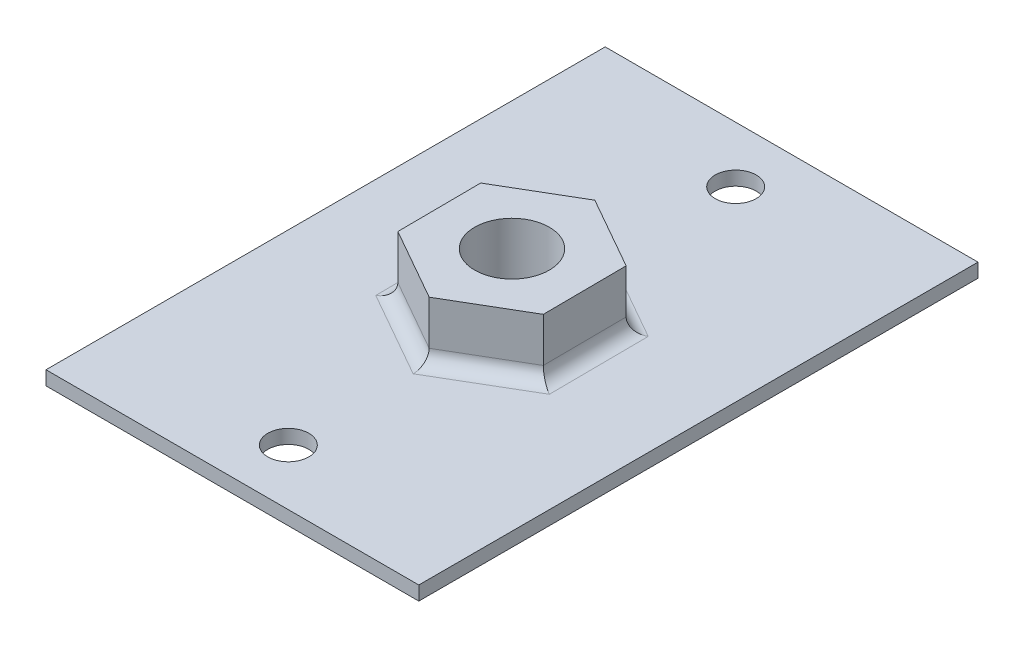
ISO-10303-21;
HEADER;
FILE_DESCRIPTION(('STEP AP214'),'2;1');
FILE_NAME('part.step','',(''),(''),'','','');
FILE_SCHEMA(('AUTOMOTIVE_DESIGN { 1 0 10303 214 1 1 1 1 }'));
ENDSEC;
DATA;
#1=APPLICATION_CONTEXT('core data for automotive mechanical design processes');
#2=APPLICATION_PROTOCOL_DEFINITION('international standard','automotive_design',2000,#1);
#3=PRODUCT_CONTEXT('',#1,'mechanical');
#4=PRODUCT('Part','Part','',(#3));
#5=PRODUCT_RELATED_PRODUCT_CATEGORY('part','',(#4));
#6=PRODUCT_DEFINITION_FORMATION('','',#4);
#7=PRODUCT_DEFINITION_CONTEXT('part definition',#1,'design');
#8=PRODUCT_DEFINITION('design','',#6,#7);
#9=PRODUCT_DEFINITION_SHAPE('','',#8);
#10=(LENGTH_UNIT() NAMED_UNIT(*) SI_UNIT(.MILLI.,.METRE.));
#11=(NAMED_UNIT(*) PLANE_ANGLE_UNIT() SI_UNIT($,.RADIAN.));
#12=(NAMED_UNIT(*) SI_UNIT($,.STERADIAN.) SOLID_ANGLE_UNIT());
#13=UNCERTAINTY_MEASURE_WITH_UNIT(LENGTH_MEASURE(1.E-05),#10,'distance_accuracy_value','');
#14=(GEOMETRIC_REPRESENTATION_CONTEXT(3) GLOBAL_UNCERTAINTY_ASSIGNED_CONTEXT((#13)) GLOBAL_UNIT_ASSIGNED_CONTEXT((#10,
#11,#12)) REPRESENTATION_CONTEXT('',''));
#15=CARTESIAN_POINT('',(0.,0.,0.));
#16=DIRECTION('',(0.,0.,1.));
#17=DIRECTION('',(1.,0.,0.));
#18=AXIS2_PLACEMENT_3D('',#15,#16,#17);
#19=CARTESIAN_POINT('',(3.89035270259153,3.125,2.21042737559322));
#20=DIRECTION('',(0.,-1.,0.));
#21=DIRECTION('',(0.,0.,-1.));
#22=AXIS2_PLACEMENT_3D('',#19,#20,#21);
#23=PLANE('',#22);
#24=DIRECTION('',(-0.00690363957882424,0.,-0.999976169596339));
#25=VECTOR('',#24,1.);
#26=CARTESIAN_POINT('',(3.89035270259153,3.125,2.21042737559322));
#27=LINE('',#26,#25);
#28=CARTESIAN_POINT('',(3.89035270259153,3.125,2.21042737559322));
#29=VERTEX_POINT('',#28);
#30=CARTESIAN_POINT('',(3.85946261178006,3.125,-2.2639305823291));
#31=VERTEX_POINT('',#30);
#32=EDGE_CURVE('E166',#29,#31,#27,.T.);
#33=ORIENTED_EDGE('',*,*,#32,.T.);
#34=DIRECTION('',(-0.869456585838897,0.,-0.494009357544337));
#35=VECTOR('',#34,1.);
#36=CARTESIAN_POINT('',(3.85946261178006,3.125,-2.2639305823291));
#37=LINE('',#36,#35);
#38=CARTESIAN_POINT('',(-0.0308900908114723,3.125,-4.47435795792232));
#39=VERTEX_POINT('',#38);
#40=EDGE_CURVE('E169',#31,#39,#37,.T.);
#41=ORIENTED_EDGE('',*,*,#40,.T.);
#42=DIRECTION('',(-0.862552946260073,0.,0.505966812052003));
#43=VECTOR('',#42,1.);
#44=CARTESIAN_POINT('',(-0.0308900908114723,3.125,-4.47435795792232));
#45=LINE('',#44,#43);
#46=CARTESIAN_POINT('',(-3.89035270259153,3.125,-2.21042737559322));
#47=VERTEX_POINT('',#46);
#48=EDGE_CURVE('E171',#39,#47,#45,.T.);
#49=ORIENTED_EDGE('',*,*,#48,.T.);
#50=DIRECTION('',(0.00690363957882444,0.,0.999976169596339));
#51=VECTOR('',#50,1.);
#52=CARTESIAN_POINT('',(-3.89035270259153,3.125,-2.21042737559322));
#53=LINE('',#52,#51);
#54=CARTESIAN_POINT('',(-3.85946261178006,3.125,2.2639305823291));
#55=VERTEX_POINT('',#54);
#56=EDGE_CURVE('E173',#47,#55,#53,.T.);
#57=ORIENTED_EDGE('',*,*,#56,.T.);
#58=DIRECTION('',(0.869456585838897,0.,0.494009357544337));
#59=VECTOR('',#58,1.);
#60=CARTESIAN_POINT('',(-3.85946261178006,3.125,2.2639305823291));
#61=LINE('',#60,#59);
#62=CARTESIAN_POINT('',(0.0308900908114716,3.125,4.47435795792233));
#63=VERTEX_POINT('',#62);
#64=EDGE_CURVE('E175',#55,#63,#61,.T.);
#65=ORIENTED_EDGE('',*,*,#64,.T.);
#66=DIRECTION('',(0.862552946260074,0.,-0.505966812052003));
#67=VECTOR('',#66,1.);
#68=CARTESIAN_POINT('',(0.0308900908114716,3.125,4.47435795792233));
#69=LINE('',#68,#67);
#70=EDGE_CURVE('E177',#63,#29,#69,.T.);
#71=ORIENTED_EDGE('',*,*,#70,.T.);
#72=EDGE_LOOP('',(#33,#41,#49,#57,#65,#71));
#73=FACE_BOUND('',#72,.T.);
#74=CARTESIAN_POINT('',(0.,3.125,0.));
#75=DIRECTION('',(0.,1.,0.));
#76=DIRECTION('',(0.,0.,1.));
#77=AXIS2_PLACEMENT_3D('',#74,#75,#76);
#78=CIRCLE('',#77,2.);
#79=CARTESIAN_POINT('',(0.,3.125,2.));
#80=VERTEX_POINT('',#79);
#81=EDGE_CURVE('E158',#80,#80,#78,.T.);
#82=ORIENTED_EDGE('',*,*,#81,.F.);
#83=EDGE_LOOP('',(#82));
#84=FACE_BOUND('',#83,.T.);
#85=ADVANCED_FACE('F32',(#73,#84),#23,.F.);
#86=CARTESIAN_POINT('',(3.89035270259153,3.125,2.21042737559322));
#87=DIRECTION('',(-0.999976169596339,0.,0.00690363957882425));
#88=DIRECTION('',(0.00690363957882425,0.,0.999976169596339));
#89=AXIS2_PLACEMENT_3D('',#86,#87,#88);
#90=PLANE('',#89);
#91=DIRECTION('',(0.,-1.,0.));
#92=VECTOR('',#91,1.);
#93=CARTESIAN_POINT('',(3.89035270259153,3.125,2.21042737559322));
#94=LINE('',#93,#92);
#95=CARTESIAN_POINT('',(3.89035270259153,0.75,2.21042737559322));
#96=VERTEX_POINT('',#95);
#97=EDGE_CURVE('E179',#29,#96,#94,.T.);
#98=ORIENTED_EDGE('',*,*,#97,.T.);
#99=DIRECTION('',(-0.00690363957882425,0.,-0.999976169596339));
#100=VECTOR('',#99,1.);
#101=CARTESIAN_POINT('',(3.85946261178006,0.75,-2.2639305823291));
#102=LINE('',#101,#100);
#103=CARTESIAN_POINT('',(3.85946261178006,0.75,-2.2639305823291));
#104=VERTEX_POINT('',#103);
#105=EDGE_CURVE('E11',#96,#104,#102,.T.);
#106=ORIENTED_EDGE('',*,*,#105,.T.);
#107=DIRECTION('',(0.,-1.,0.));
#108=VECTOR('',#107,1.);
#109=CARTESIAN_POINT('',(3.85946261178006,3.125,-2.2639305823291));
#110=LINE('',#109,#108);
#111=EDGE_CURVE('E191',#31,#104,#110,.T.);
#112=ORIENTED_EDGE('',*,*,#111,.F.);
#113=ORIENTED_EDGE('',*,*,#32,.F.);
#114=EDGE_LOOP('',(#98,#106,#112,#113));
#115=FACE_BOUND('',#114,.T.);
#116=ADVANCED_FACE('F34',(#115),#90,.F.);
#117=CARTESIAN_POINT('',(3.85946261178006,3.125,-2.2639305823291));
#118=DIRECTION('',(-0.494009357544337,0.,0.869456585838898));
#119=DIRECTION('',(0.869456585838898,0.,0.494009357544337));
#120=AXIS2_PLACEMENT_3D('',#117,#118,#119);
#121=PLANE('',#120);
#122=ORIENTED_EDGE('',*,*,#111,.T.);
#123=DIRECTION('',(-0.869456585838898,0.,-0.494009357544337));
#124=VECTOR('',#123,1.);
#125=CARTESIAN_POINT('',(-0.0308900908114742,0.75,-4.47435795792232));
#126=LINE('',#125,#124);
#127=CARTESIAN_POINT('',(-0.0308900908114723,0.75,-4.47435795792232));
#128=VERTEX_POINT('',#127);
#129=EDGE_CURVE('E194',#104,#128,#126,.T.);
#130=ORIENTED_EDGE('',*,*,#129,.T.);
#131=DIRECTION('',(0.,-1.,0.));
#132=VECTOR('',#131,1.);
#133=CARTESIAN_POINT('',(-0.0308900908114723,3.125,-4.47435795792232));
#134=LINE('',#133,#132);
#135=EDGE_CURVE('E188',#39,#128,#134,.T.);
#136=ORIENTED_EDGE('',*,*,#135,.F.);
#137=ORIENTED_EDGE('',*,*,#40,.F.);
#138=EDGE_LOOP('',(#122,#130,#136,#137));
#139=FACE_BOUND('',#138,.T.);
#140=ADVANCED_FACE('F303',(#139),#121,.F.);
#141=CARTESIAN_POINT('',(-0.0308900908114723,3.125,-4.47435795792232));
#142=DIRECTION('',(0.505966812052003,0.,0.862552946260073));
#143=DIRECTION('',(0.862552946260073,0.,-0.505966812052003));
#144=AXIS2_PLACEMENT_3D('',#141,#142,#143);
#145=PLANE('',#144);
#146=ORIENTED_EDGE('',*,*,#135,.T.);
#147=DIRECTION('',(-0.862552946260073,0.,0.505966812052003));
#148=VECTOR('',#147,1.);
#149=CARTESIAN_POINT('',(-3.89035270259153,0.75,-2.21042737559322));
#150=LINE('',#149,#148);
#151=CARTESIAN_POINT('',(-3.89035270259153,0.75,-2.21042737559322));
#152=VERTEX_POINT('',#151);
#153=EDGE_CURVE('E210',#128,#152,#150,.T.);
#154=ORIENTED_EDGE('',*,*,#153,.T.);
#155=DIRECTION('',(0.,-1.,0.));
#156=VECTOR('',#155,1.);
#157=CARTESIAN_POINT('',(-3.89035270259153,3.125,-2.21042737559322));
#158=LINE('',#157,#156);
#159=EDGE_CURVE('E185',#47,#152,#158,.T.);
#160=ORIENTED_EDGE('',*,*,#159,.F.);
#161=ORIENTED_EDGE('',*,*,#48,.F.);
#162=EDGE_LOOP('',(#146,#154,#160,#161));
#163=FACE_BOUND('',#162,.T.);
#164=ADVANCED_FACE('F316',(#163),#145,.F.);
#165=CARTESIAN_POINT('',(-3.89035270259153,3.125,-2.21042737559322));
#166=DIRECTION('',(0.999976169596339,0.,-0.00690363957882444));
#167=DIRECTION('',(-0.00690363957882444,0.,-0.999976169596339));
#168=AXIS2_PLACEMENT_3D('',#165,#166,#167);
#169=PLANE('',#168);
#170=ORIENTED_EDGE('',*,*,#159,.T.);
#171=DIRECTION('',(0.00690363957882444,0.,0.999976169596339));
#172=VECTOR('',#171,1.);
#173=CARTESIAN_POINT('',(-3.85946261178006,0.75,2.26393058232911));
#174=LINE('',#173,#172);
#175=CARTESIAN_POINT('',(-3.85946261178006,0.75,2.2639305823291));
#176=VERTEX_POINT('',#175);
#177=EDGE_CURVE('E212',#152,#176,#174,.T.);
#178=ORIENTED_EDGE('',*,*,#177,.T.);
#179=DIRECTION('',(0.,-1.,0.));
#180=VECTOR('',#179,1.);
#181=CARTESIAN_POINT('',(-3.85946261178006,3.125,2.2639305823291));
#182=LINE('',#181,#180);
#183=EDGE_CURVE('E183',#55,#176,#182,.T.);
#184=ORIENTED_EDGE('',*,*,#183,.F.);
#185=ORIENTED_EDGE('',*,*,#56,.F.);
#186=EDGE_LOOP('',(#170,#178,#184,#185));
#187=FACE_BOUND('',#186,.T.);
#188=ADVANCED_FACE('F217',(#187),#169,.F.);
#189=CARTESIAN_POINT('',(-3.85946261178006,3.125,2.2639305823291));
#190=DIRECTION('',(0.494009357544337,0.,-0.869456585838897));
#191=DIRECTION('',(-0.869456585838897,0.,-0.494009357544337));
#192=AXIS2_PLACEMENT_3D('',#189,#190,#191);
#193=PLANE('',#192);
#194=ORIENTED_EDGE('',*,*,#183,.T.);
#195=DIRECTION('',(0.869456585838897,0.,0.494009357544337));
#196=VECTOR('',#195,1.);
#197=CARTESIAN_POINT('',(0.0308900908114722,0.75,4.47435795792233));
#198=LINE('',#197,#196);
#199=CARTESIAN_POINT('',(0.0308900908114716,0.75,4.47435795792233));
#200=VERTEX_POINT('',#199);
#201=EDGE_CURVE('E54',#176,#200,#198,.T.);
#202=ORIENTED_EDGE('',*,*,#201,.T.);
#203=DIRECTION('',(0.,-1.,0.));
#204=VECTOR('',#203,1.);
#205=CARTESIAN_POINT('',(0.0308900908114716,3.125,4.47435795792233));
#206=LINE('',#205,#204);
#207=EDGE_CURVE('E181',#63,#200,#206,.T.);
#208=ORIENTED_EDGE('',*,*,#207,.F.);
#209=ORIENTED_EDGE('',*,*,#64,.F.);
#210=EDGE_LOOP('',(#194,#202,#208,#209));
#211=FACE_BOUND('',#210,.T.);
#212=ADVANCED_FACE('F225',(#211),#193,.F.);
#213=CARTESIAN_POINT('',(0.0308900908114716,3.125,4.47435795792233));
#214=DIRECTION('',(-0.505966812052003,0.,-0.862552946260074));
#215=DIRECTION('',(-0.862552946260074,0.,0.505966812052003));
#216=AXIS2_PLACEMENT_3D('',#213,#214,#215);
#217=PLANE('',#216);
#218=ORIENTED_EDGE('',*,*,#207,.T.);
#219=DIRECTION('',(0.862552946260074,0.,-0.505966812052003));
#220=VECTOR('',#219,1.);
#221=CARTESIAN_POINT('',(3.89035270259153,0.75,2.21042737559322));
#222=LINE('',#221,#220);
#223=EDGE_CURVE('E40',#200,#96,#222,.T.);
#224=ORIENTED_EDGE('',*,*,#223,.T.);
#225=ORIENTED_EDGE('',*,*,#97,.F.);
#226=ORIENTED_EDGE('',*,*,#70,.F.);
#227=EDGE_LOOP('',(#218,#224,#225,#226));
#228=FACE_BOUND('',#227,.T.);
#229=ADVANCED_FACE('F309',(#228),#217,.F.);
#230=CARTESIAN_POINT('',(0.,3.125,0.));
#231=DIRECTION('',(0.,-1.,0.));
#232=DIRECTION('',(0.,0.,-1.));
#233=AXIS2_PLACEMENT_3D('',#230,#231,#232);
#234=CYLINDRICAL_SURFACE('',#233,2.);
#235=ORIENTED_EDGE('',*,*,#81,.T.);
#236=EDGE_LOOP('',(#235));
#237=FACE_BOUND('',#236,.T.);
#238=CARTESIAN_POINT('',(0.,0.,0.));
#239=DIRECTION('',(0.,1.,0.));
#240=DIRECTION('',(0.,0.,1.));
#241=AXIS2_PLACEMENT_3D('',#238,#239,#240);
#242=CIRCLE('',#241,2.);
#243=CARTESIAN_POINT('',(0.,0.,2.));
#244=VERTEX_POINT('',#243);
#245=EDGE_CURVE('E154',#244,#244,#242,.T.);
#246=ORIENTED_EDGE('',*,*,#245,.F.);
#247=EDGE_LOOP('',(#246));
#248=FACE_BOUND('',#247,.T.);
#249=ADVANCED_FACE('F293',(#237,#248),#234,.F.);
#250=CARTESIAN_POINT('',(10.,0.,15.));
#251=DIRECTION('',(0.,-1.,0.));
#252=DIRECTION('',(0.,0.,-1.));
#253=AXIS2_PLACEMENT_3D('',#250,#251,#252);
#254=PLANE('',#253);
#255=ORIENTED_EDGE('',*,*,#245,.T.);
#256=EDGE_LOOP('',(#255));
#257=FACE_BOUND('',#256,.T.);
#258=ADVANCED_FACE('F287',(#257),#254,.F.);
#259=DIRECTION('',(-0.862552946260073,0.,0.505966812052003));
#260=VECTOR('',#259,1.);
#261=CARTESIAN_POINT('',(-0.410365199850475,0.,-5.12127266761738));
#262=LINE('',#261,#260);
#263=CARTESIAN_POINT('',(-4.6433241934157,0.,-2.63825202893384));
#264=VERTEX_POINT('',#263);
#265=CARTESIAN_POINT('',(-0.036868818065305,0.,-5.34036272397181));
#266=VERTEX_POINT('',#265);
#267=EDGE_CURVE('E205',#264,#266,#262,.F.);
#268=ORIENTED_EDGE('',*,*,#267,.T.);
#269=DIRECTION('',(-0.869456585838898,0.,-0.494009357544337));
#270=VECTOR('',#269,1.);
#271=CARTESIAN_POINT('',(4.22996962993831,0.,-2.91602302170828));
#272=LINE('',#271,#270);
#273=CARTESIAN_POINT('',(4.6064553753504,0.,-2.70211069503796));
#274=VERTEX_POINT('',#273);
#275=EDGE_CURVE('E207',#266,#274,#272,.F.);
#276=ORIENTED_EDGE('',*,*,#275,.T.);
#277=DIRECTION('',(-0.00690363957882425,0.,-0.999976169596339));
#278=VECTOR('',#277,1.);
#279=CARTESIAN_POINT('',(4.64033482978879,0.,2.2052496459091));
#280=LINE('',#279,#278);
#281=CARTESIAN_POINT('',(4.64332419341571,0.,2.63825202893384));
#282=VERTEX_POINT('',#281);
#283=EDGE_CURVE('E197',#274,#282,#280,.F.);
#284=ORIENTED_EDGE('',*,*,#283,.T.);
#285=DIRECTION('',(0.862552946260074,0.,-0.505966812052003));
#286=VECTOR('',#285,1.);
#287=CARTESIAN_POINT('',(0.410365199850474,0.,5.12127266761738));
#288=LINE('',#287,#286);
#289=CARTESIAN_POINT('',(0.0368688180653053,0.,5.34036272397181));
#290=VERTEX_POINT('',#289);
#291=EDGE_CURVE('E199',#282,#290,#288,.F.);
#292=ORIENTED_EDGE('',*,*,#291,.T.);
#293=DIRECTION('',(0.869456585838897,0.,0.494009357544337));
#294=VECTOR('',#293,1.);
#295=CARTESIAN_POINT('',(-4.22996962993831,0.,2.91602302170828));
#296=LINE('',#295,#294);
#297=CARTESIAN_POINT('',(-4.6064553753504,0.,2.70211069503797));
#298=VERTEX_POINT('',#297);
#299=EDGE_CURVE('E201',#290,#298,#296,.F.);
#300=ORIENTED_EDGE('',*,*,#299,.T.);
#301=DIRECTION('',(0.00690363957882444,0.,0.999976169596339));
#302=VECTOR('',#301,1.);
#303=CARTESIAN_POINT('',(-4.64033482978879,0.,-2.2052496459091));
#304=LINE('',#303,#302);
#305=EDGE_CURVE('E203',#298,#264,#304,.F.);
#306=ORIENTED_EDGE('',*,*,#305,.T.);
#307=EDGE_LOOP('',(#268,#276,#284,#292,#300,#306));
#308=FACE_BOUND('',#307,.T.);
#309=CARTESIAN_POINT('',(0.,0.,-12.));
#310=DIRECTION('',(0.,-1.,0.));
#311=DIRECTION('',(0.,0.,-1.));
#312=AXIS2_PLACEMENT_3D('',#309,#310,#311);
#313=CIRCLE('',#312,1.1);
#314=CARTESIAN_POINT('',(0.,0.,-13.1));
#315=VERTEX_POINT('',#314);
#316=EDGE_CURVE('E250',#315,#315,#313,.T.);
#317=ORIENTED_EDGE('',*,*,#316,.T.);
#318=EDGE_LOOP('',(#317));
#319=FACE_BOUND('',#318,.T.);
#320=DIRECTION('',(-1.,0.,0.));
#321=VECTOR('',#320,1.);
#322=CARTESIAN_POINT('',(-10.,0.,15.));
#323=LINE('',#322,#321);
#324=CARTESIAN_POINT('',(10.,0.,15.));
#325=VERTEX_POINT('',#324);
#326=CARTESIAN_POINT('',(-10.,0.,15.));
#327=VERTEX_POINT('',#326);
#328=EDGE_CURVE('E142',#325,#327,#323,.T.);
#329=ORIENTED_EDGE('',*,*,#328,.F.);
#330=DIRECTION('',(0.,0.,1.));
#331=VECTOR('',#330,1.);
#332=CARTESIAN_POINT('',(10.,0.,0.));
#333=LINE('',#332,#331);
#334=CARTESIAN_POINT('',(10.,0.,-15.));
#335=VERTEX_POINT('',#334);
#336=EDGE_CURVE('E129',#335,#325,#333,.T.);
#337=ORIENTED_EDGE('',*,*,#336,.F.);
#338=DIRECTION('',(1.,0.,0.));
#339=VECTOR('',#338,1.);
#340=CARTESIAN_POINT('',(10.,0.,-15.));
#341=LINE('',#340,#339);
#342=CARTESIAN_POINT('',(-10.,0.,-15.));
#343=VERTEX_POINT('',#342);
#344=EDGE_CURVE('E139',#343,#335,#341,.T.);
#345=ORIENTED_EDGE('',*,*,#344,.F.);
#346=DIRECTION('',(0.,0.,-1.));
#347=VECTOR('',#346,1.);
#348=CARTESIAN_POINT('',(-10.,0.,-15.));
#349=LINE('',#348,#347);
#350=EDGE_CURVE('E145',#327,#343,#349,.T.);
#351=ORIENTED_EDGE('',*,*,#350,.F.);
#352=EDGE_LOOP('',(#329,#337,#345,#351));
#353=FACE_BOUND('',#352,.T.);
#354=CARTESIAN_POINT('',(0.,0.,12.));
#355=DIRECTION('',(0.,-1.,0.));
#356=DIRECTION('',(0.,0.,1.));
#357=AXIS2_PLACEMENT_3D('',#354,#355,#356);
#358=CIRCLE('',#357,1.1);
#359=CARTESIAN_POINT('',(0.,0.,13.1));
#360=VERTEX_POINT('',#359);
#361=EDGE_CURVE('E238',#360,#360,#358,.T.);
#362=ORIENTED_EDGE('',*,*,#361,.T.);
#363=EDGE_LOOP('',(#362));
#364=FACE_BOUND('',#363,.T.);
#365=ADVANCED_FACE('F143',(#308,#319,#353,#364),#254,.F.);
#366=CARTESIAN_POINT('',(10.,-0.75,15.));
#367=DIRECTION('',(0.,-1.,0.));
#368=DIRECTION('',(0.,0.,-1.));
#369=AXIS2_PLACEMENT_3D('',#366,#367,#368);
#370=PLANE('',#369);
#371=CARTESIAN_POINT('',(0.,-0.75,-12.));
#372=DIRECTION('',(0.,-1.,0.));
#373=DIRECTION('',(0.,0.,-1.));
#374=AXIS2_PLACEMENT_3D('',#371,#372,#373);
#375=CIRCLE('',#374,1.1);
#376=CARTESIAN_POINT('',(0.,-0.75,-13.1));
#377=VERTEX_POINT('',#376);
#378=EDGE_CURVE('E149',#377,#377,#375,.T.);
#379=ORIENTED_EDGE('',*,*,#378,.F.);
#380=EDGE_LOOP('',(#379));
#381=FACE_BOUND('',#380,.T.);
#382=DIRECTION('',(0.,0.,1.));
#383=VECTOR('',#382,1.);
#384=CARTESIAN_POINT('',(10.,-0.75,15.));
#385=LINE('',#384,#383);
#386=CARTESIAN_POINT('',(10.,-0.75,-15.));
#387=VERTEX_POINT('',#386);
#388=CARTESIAN_POINT('',(10.,-0.75,15.));
#389=VERTEX_POINT('',#388);
#390=EDGE_CURVE('E138',#387,#389,#385,.T.);
#391=ORIENTED_EDGE('',*,*,#390,.T.);
#392=DIRECTION('',(-1.,0.,0.));
#393=VECTOR('',#392,1.);
#394=CARTESIAN_POINT('',(-10.,-0.75,15.));
#395=LINE('',#394,#393);
#396=CARTESIAN_POINT('',(-10.,-0.75,15.));
#397=VERTEX_POINT('',#396);
#398=EDGE_CURVE('E152',#389,#397,#395,.T.);
#399=ORIENTED_EDGE('',*,*,#398,.T.);
#400=DIRECTION('',(0.,0.,-1.));
#401=VECTOR('',#400,1.);
#402=CARTESIAN_POINT('',(-10.,-0.75,-15.));
#403=LINE('',#402,#401);
#404=CARTESIAN_POINT('',(-10.,-0.75,-15.));
#405=VERTEX_POINT('',#404);
#406=EDGE_CURVE('E259',#397,#405,#403,.T.);
#407=ORIENTED_EDGE('',*,*,#406,.T.);
#408=DIRECTION('',(1.,0.,0.));
#409=VECTOR('',#408,1.);
#410=CARTESIAN_POINT('',(10.,-0.75,-15.));
#411=LINE('',#410,#409);
#412=EDGE_CURVE('E261',#405,#387,#411,.T.);
#413=ORIENTED_EDGE('',*,*,#412,.T.);
#414=EDGE_LOOP('',(#391,#399,#407,#413));
#415=FACE_BOUND('',#414,.T.);
#416=CARTESIAN_POINT('',(0.,-0.75,12.));
#417=DIRECTION('',(0.,-1.,0.));
#418=DIRECTION('',(0.,0.,1.));
#419=AXIS2_PLACEMENT_3D('',#416,#417,#418);
#420=CIRCLE('',#419,1.1);
#421=CARTESIAN_POINT('',(0.,-0.75,13.1));
#422=VERTEX_POINT('',#421);
#423=EDGE_CURVE('E247',#422,#422,#420,.T.);
#424=ORIENTED_EDGE('',*,*,#423,.F.);
#425=EDGE_LOOP('',(#424));
#426=FACE_BOUND('',#425,.T.);
#427=ADVANCED_FACE('F273',(#381,#415,#426),#370,.T.);
#428=CARTESIAN_POINT('',(-10.,-0.75,15.));
#429=DIRECTION('',(0.,0.,-1.));
#430=DIRECTION('',(-1.,0.,0.));
#431=AXIS2_PLACEMENT_3D('',#428,#429,#430);
#432=PLANE('',#431);
#433=ORIENTED_EDGE('',*,*,#328,.T.);
#434=DIRECTION('',(0.,1.,0.));
#435=VECTOR('',#434,1.);
#436=CARTESIAN_POINT('',(-10.,-0.75,15.));
#437=LINE('',#436,#435);
#438=EDGE_CURVE('E155',#397,#327,#437,.T.);
#439=ORIENTED_EDGE('',*,*,#438,.F.);
#440=ORIENTED_EDGE('',*,*,#398,.F.);
#441=DIRECTION('',(0.,1.,0.));
#442=VECTOR('',#441,1.);
#443=CARTESIAN_POINT('',(10.,-0.75,15.));
#444=LINE('',#443,#442);
#445=EDGE_CURVE('E133',#389,#325,#444,.T.);
#446=ORIENTED_EDGE('',*,*,#445,.T.);
#447=EDGE_LOOP('',(#433,#439,#440,#446));
#448=FACE_BOUND('',#447,.T.);
#449=ADVANCED_FACE('F151',(#448),#432,.F.);
#450=CARTESIAN_POINT('',(-10.,-0.75,-15.));
#451=DIRECTION('',(1.,0.,0.));
#452=DIRECTION('',(0.,0.,-1.));
#453=AXIS2_PLACEMENT_3D('',#450,#451,#452);
#454=PLANE('',#453);
#455=ORIENTED_EDGE('',*,*,#350,.T.);
#456=DIRECTION('',(0.,1.,0.));
#457=VECTOR('',#456,1.);
#458=CARTESIAN_POINT('',(-10.,-0.75,-15.));
#459=LINE('',#458,#457);
#460=EDGE_CURVE('E160',#405,#343,#459,.T.);
#461=ORIENTED_EDGE('',*,*,#460,.F.);
#462=ORIENTED_EDGE('',*,*,#406,.F.);
#463=ORIENTED_EDGE('',*,*,#438,.T.);
#464=EDGE_LOOP('',(#455,#461,#462,#463));
#465=FACE_BOUND('',#464,.T.);
#466=ADVANCED_FACE('F271',(#465),#454,.F.);
#467=CARTESIAN_POINT('',(10.,-0.75,-15.));
#468=DIRECTION('',(0.,0.,1.));
#469=DIRECTION('',(1.,0.,0.));
#470=AXIS2_PLACEMENT_3D('',#467,#468,#469);
#471=PLANE('',#470);
#472=ORIENTED_EDGE('',*,*,#344,.T.);
#473=DIRECTION('',(0.,1.,0.));
#474=VECTOR('',#473,1.);
#475=CARTESIAN_POINT('',(10.,-0.75,-15.));
#476=LINE('',#475,#474);
#477=EDGE_CURVE('E135',#387,#335,#476,.T.);
#478=ORIENTED_EDGE('',*,*,#477,.F.);
#479=ORIENTED_EDGE('',*,*,#412,.F.);
#480=ORIENTED_EDGE('',*,*,#460,.T.);
#481=EDGE_LOOP('',(#472,#478,#479,#480));
#482=FACE_BOUND('',#481,.T.);
#483=ADVANCED_FACE('F268',(#482),#471,.F.);
#484=CARTESIAN_POINT('',(10.,-0.75,0.));
#485=DIRECTION('',(-1.,0.,0.));
#486=DIRECTION('',(0.,0.,1.));
#487=AXIS2_PLACEMENT_3D('',#484,#485,#486);
#488=PLANE('',#487);
#489=ORIENTED_EDGE('',*,*,#336,.T.);
#490=ORIENTED_EDGE('',*,*,#445,.F.);
#491=ORIENTED_EDGE('',*,*,#390,.F.);
#492=ORIENTED_EDGE('',*,*,#477,.T.);
#493=EDGE_LOOP('',(#489,#490,#491,#492));
#494=FACE_BOUND('',#493,.T.);
#495=ADVANCED_FACE('F131',(#494),#488,.F.);
#496=CARTESIAN_POINT('',(0.,-0.75,-12.));
#497=DIRECTION('',(0.,1.,0.));
#498=DIRECTION('',(0.,0.,1.));
#499=AXIS2_PLACEMENT_3D('',#496,#497,#498);
#500=CYLINDRICAL_SURFACE('',#499,1.1);
#501=ORIENTED_EDGE('',*,*,#378,.T.);
#502=EDGE_LOOP('',(#501));
#503=FACE_BOUND('',#502,.T.);
#504=ORIENTED_EDGE('',*,*,#316,.F.);
#505=EDGE_LOOP('',(#504));
#506=FACE_BOUND('',#505,.T.);
#507=ADVANCED_FACE('F283',(#503,#506),#500,.F.);
#508=CARTESIAN_POINT('',(0.,-0.75,12.));
#509=DIRECTION('',(0.,1.,0.));
#510=DIRECTION('',(0.,0.,1.));
#511=AXIS2_PLACEMENT_3D('',#508,#509,#510);
#512=CYLINDRICAL_SURFACE('',#511,1.1);
#513=ORIENTED_EDGE('',*,*,#423,.T.);
#514=EDGE_LOOP('',(#513));
#515=FACE_BOUND('',#514,.T.);
#516=ORIENTED_EDGE('',*,*,#361,.F.);
#517=EDGE_LOOP('',(#516));
#518=FACE_BOUND('',#517,.T.);
#519=ADVANCED_FACE('F280',(#515,#518),#512,.F.);
#520=CARTESIAN_POINT('',(-4.22996962993831,0.75,2.91602302170828));
#521=DIRECTION('',(-0.869456585838897,0.,-0.494009357544337));
#522=DIRECTION('',(-0.494009357544337,0.,0.869456585838897));
#523=AXIS2_PLACEMENT_3D('',#520,#521,#522);
#524=CYLINDRICAL_SURFACE('',#523,0.75);
#525=CARTESIAN_POINT('',(-4.6064553753504,0.75,2.70211069503797));
#526=DIRECTION('',(-0.505966812052003,0.,-0.862552946260074));
#527=DIRECTION('',(-0.862552946260074,0.,0.505966812052003));
#528=AXIS2_PLACEMENT_3D('',#525,#526,#527);
#529=ELLIPSE('',#528,0.866025403784438,0.75);
#530=EDGE_CURVE('E231',#298,#176,#529,.F.);
#531=ORIENTED_EDGE('',*,*,#530,.F.);
#532=ORIENTED_EDGE('',*,*,#299,.F.);
#533=CARTESIAN_POINT('',(0.0368688180653059,0.75,5.34036272397181));
#534=DIRECTION('',(-0.999976169596339,0.,0.00690363957882389));
#535=DIRECTION('',(0.00690363957882389,0.,0.999976169596339));
#536=AXIS2_PLACEMENT_3D('',#533,#534,#535);
#537=ELLIPSE('',#536,0.866025403784439,0.75);
#538=EDGE_CURVE('E234',#200,#290,#537,.T.);
#539=ORIENTED_EDGE('',*,*,#538,.F.);
#540=ORIENTED_EDGE('',*,*,#201,.F.);
#541=EDGE_LOOP('',(#531,#532,#539,#540));
#542=FACE_BOUND('',#541,.T.);
#543=ADVANCED_FACE('F229',(#542),#524,.F.);
#544=CARTESIAN_POINT('',(0.410365199850474,0.75,5.12127266761738));
#545=DIRECTION('',(-0.862552946260074,0.,0.505966812052003));
#546=DIRECTION('',(0.505966812052003,0.,0.862552946260074));
#547=AXIS2_PLACEMENT_3D('',#544,#545,#546);
#548=CYLINDRICAL_SURFACE('',#547,0.75);
#549=ORIENTED_EDGE('',*,*,#538,.T.);
#550=ORIENTED_EDGE('',*,*,#291,.F.);
#551=CARTESIAN_POINT('',(4.64332419341571,0.75,2.63825202893384));
#552=DIRECTION('',(-0.494009357544336,0.,0.869456585838898));
#553=DIRECTION('',(0.869456585838898,0.,0.494009357544336));
#554=AXIS2_PLACEMENT_3D('',#551,#552,#553);
#555=ELLIPSE('',#554,0.866025403784439,0.75);
#556=EDGE_CURVE('E236',#96,#282,#555,.T.);
#557=ORIENTED_EDGE('',*,*,#556,.F.);
#558=ORIENTED_EDGE('',*,*,#223,.F.);
#559=EDGE_LOOP('',(#549,#550,#557,#558));
#560=FACE_BOUND('',#559,.T.);
#561=ADVANCED_FACE('F349',(#560),#548,.F.);
#562=CARTESIAN_POINT('',(-4.64033482978879,0.75,-2.2052496459091));
#563=DIRECTION('',(-0.00690363957882444,0.,-0.999976169596339));
#564=DIRECTION('',(-0.999976169596339,0.,0.00690363957882444));
#565=AXIS2_PLACEMENT_3D('',#562,#563,#564);
#566=CYLINDRICAL_SURFACE('',#565,0.75);
#567=ORIENTED_EDGE('',*,*,#530,.T.);
#568=ORIENTED_EDGE('',*,*,#177,.F.);
#569=CARTESIAN_POINT('',(-4.6433241934157,0.75,-2.63825202893384));
#570=DIRECTION('',(0.494009357544336,0.,-0.869456585838898));
#571=DIRECTION('',(-0.869456585838898,0.,-0.494009357544336));
#572=AXIS2_PLACEMENT_3D('',#569,#570,#571);
#573=ELLIPSE('',#572,0.866025403784439,0.75);
#574=EDGE_CURVE('E241',#264,#152,#573,.F.);
#575=ORIENTED_EDGE('',*,*,#574,.F.);
#576=ORIENTED_EDGE('',*,*,#305,.F.);
#577=EDGE_LOOP('',(#567,#568,#575,#576));
#578=FACE_BOUND('',#577,.T.);
#579=ADVANCED_FACE('F235',(#578),#566,.F.);
#580=CARTESIAN_POINT('',(4.64033482978879,0.75,2.2052496459091));
#581=DIRECTION('',(0.00690363957882425,0.,0.999976169596339));
#582=DIRECTION('',(0.999976169596339,0.,-0.00690363957882425));
#583=AXIS2_PLACEMENT_3D('',#580,#581,#582);
#584=CYLINDRICAL_SURFACE('',#583,0.75);
#585=ORIENTED_EDGE('',*,*,#556,.T.);
#586=ORIENTED_EDGE('',*,*,#283,.F.);
#587=CARTESIAN_POINT('',(4.6064553753504,0.75,-2.70211069503796));
#588=DIRECTION('',(0.505966812052003,0.,0.862552946260074));
#589=DIRECTION('',(-0.862552946260074,0.,0.505966812052002));
#590=AXIS2_PLACEMENT_3D('',#587,#588,#589);
#591=ELLIPSE('',#590,0.866025403784438,0.75);
#592=EDGE_CURVE('E331',#104,#274,#591,.T.);
#593=ORIENTED_EDGE('',*,*,#592,.F.);
#594=ORIENTED_EDGE('',*,*,#105,.F.);
#595=EDGE_LOOP('',(#585,#586,#593,#594));
#596=FACE_BOUND('',#595,.T.);
#597=ADVANCED_FACE('F332',(#596),#584,.F.);
#598=CARTESIAN_POINT('',(-0.410365199850475,0.75,-5.12127266761738));
#599=DIRECTION('',(0.862552946260073,0.,-0.505966812052003));
#600=DIRECTION('',(-0.505966812052003,0.,-0.862552946260073));
#601=AXIS2_PLACEMENT_3D('',#598,#599,#600);
#602=CYLINDRICAL_SURFACE('',#601,0.75);
#603=ORIENTED_EDGE('',*,*,#574,.T.);
#604=ORIENTED_EDGE('',*,*,#153,.F.);
#605=CARTESIAN_POINT('',(-0.0368688180653068,0.75,-5.34036272397181));
#606=DIRECTION('',(0.999976169596339,0.,-0.00690363957882405));
#607=DIRECTION('',(-0.00690363957882422,0.,-0.999976169596339));
#608=AXIS2_PLACEMENT_3D('',#605,#606,#607);
#609=ELLIPSE('',#608,0.866025403784439,0.75);
#610=EDGE_CURVE('E335',#266,#128,#609,.F.);
#611=ORIENTED_EDGE('',*,*,#610,.F.);
#612=ORIENTED_EDGE('',*,*,#267,.F.);
#613=EDGE_LOOP('',(#603,#604,#611,#612));
#614=FACE_BOUND('',#613,.T.);
#615=ADVANCED_FACE('F343',(#614),#602,.F.);
#616=CARTESIAN_POINT('',(4.22996962993831,0.75,-2.91602302170828));
#617=DIRECTION('',(0.869456585838898,0.,0.494009357544337));
#618=DIRECTION('',(0.494009357544337,0.,-0.869456585838898));
#619=AXIS2_PLACEMENT_3D('',#616,#617,#618);
#620=CYLINDRICAL_SURFACE('',#619,0.75);
#621=ORIENTED_EDGE('',*,*,#592,.T.);
#622=ORIENTED_EDGE('',*,*,#275,.F.);
#623=ORIENTED_EDGE('',*,*,#610,.T.);
#624=ORIENTED_EDGE('',*,*,#129,.F.);
#625=EDGE_LOOP('',(#621,#622,#623,#624));
#626=FACE_BOUND('',#625,.T.);
#627=ADVANCED_FACE('F337',(#626),#620,.F.);
#628=CLOSED_SHELL('',(#85,#116,#140,#164,#188,#212,#229,#249,#258,#365,#427,#449,#466,#483,#495,
#507,#519,#543,#561,#579,#597,#615,#627));
#629=MANIFOLD_SOLID_BREP('B2',#628);
#630=ADVANCED_BREP_SHAPE_REPRESENTATION('',(#18,#629),#14);
#631=SHAPE_DEFINITION_REPRESENTATION(#9,#630);
ENDSEC;
END-ISO-10303-21;
